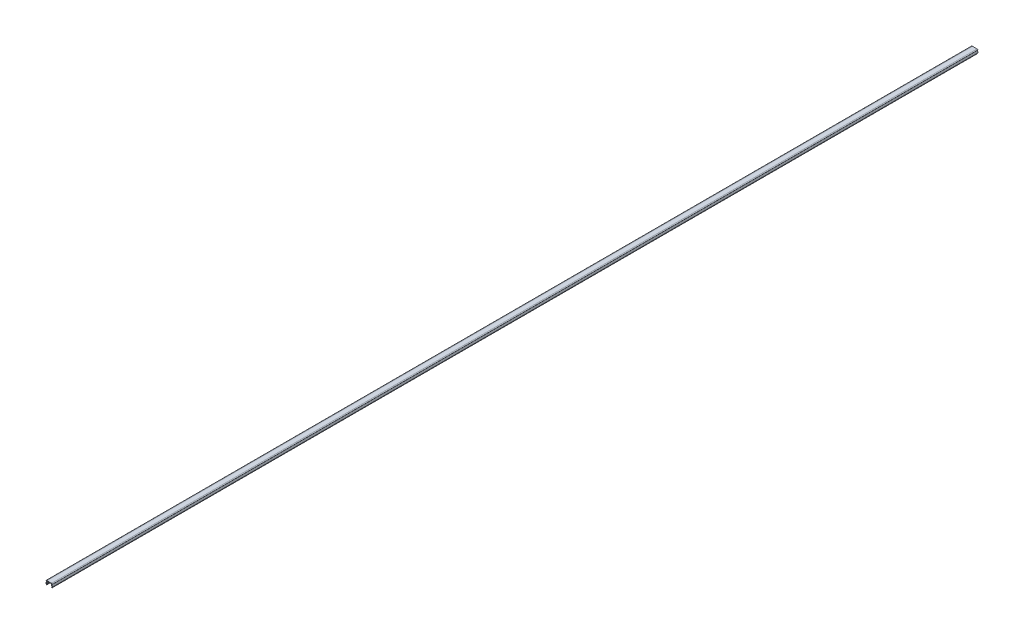
ISO-10303-21;
HEADER;
FILE_DESCRIPTION(('STEP AP214'),'2;1');
FILE_NAME('part.step','',(''),(''),'','','');
FILE_SCHEMA(('AUTOMOTIVE_DESIGN { 1 0 10303 214 1 1 1 1 }'));
ENDSEC;
DATA;
#1=APPLICATION_CONTEXT('core data for automotive mechanical design processes');
#2=APPLICATION_PROTOCOL_DEFINITION('international standard','automotive_design',2000,#1);
#3=PRODUCT_CONTEXT('',#1,'mechanical');
#4=PRODUCT('Part','Part','',(#3));
#5=PRODUCT_RELATED_PRODUCT_CATEGORY('part','',(#4));
#6=PRODUCT_DEFINITION_FORMATION('','',#4);
#7=PRODUCT_DEFINITION_CONTEXT('part definition',#1,'design');
#8=PRODUCT_DEFINITION('design','',#6,#7);
#9=PRODUCT_DEFINITION_SHAPE('','',#8);
#10=(LENGTH_UNIT() NAMED_UNIT(*) SI_UNIT(.MILLI.,.METRE.));
#11=(NAMED_UNIT(*) PLANE_ANGLE_UNIT() SI_UNIT($,.RADIAN.));
#12=(NAMED_UNIT(*) SI_UNIT($,.STERADIAN.) SOLID_ANGLE_UNIT());
#13=UNCERTAINTY_MEASURE_WITH_UNIT(LENGTH_MEASURE(1.E-05),#10,'distance_accuracy_value','');
#14=(GEOMETRIC_REPRESENTATION_CONTEXT(3) GLOBAL_UNCERTAINTY_ASSIGNED_CONTEXT((#13)) GLOBAL_UNIT_ASSIGNED_CONTEXT((#10,
#11,#12)) REPRESENTATION_CONTEXT('',''));
#15=CARTESIAN_POINT('',(0.,0.,0.));
#16=DIRECTION('',(0.,0.,1.));
#17=DIRECTION('',(1.,0.,0.));
#18=AXIS2_PLACEMENT_3D('',#15,#16,#17);
#19=CARTESIAN_POINT('',(0.,4.2,1000.));
#20=DIRECTION('',(0.,-1.,0.));
#21=DIRECTION('',(0.,0.,-1.));
#22=AXIS2_PLACEMENT_3D('',#19,#20,#21);
#23=PLANE('',#22);
#24=DIRECTION('',(-1.,0.,0.));
#25=VECTOR('',#24,1.);
#26=CARTESIAN_POINT('',(0.,4.2,1000.));
#27=LINE('',#26,#25);
#28=CARTESIAN_POINT('',(2.5,4.2,1000.));
#29=VERTEX_POINT('',#28);
#30=CARTESIAN_POINT('',(-2.5,4.2,1000.));
#31=VERTEX_POINT('',#30);
#32=EDGE_CURVE('E242',#29,#31,#27,.T.);
#33=ORIENTED_EDGE('',*,*,#32,.F.);
#34=CARTESIAN_POINT('',(2.5,4.2,-50.));
#35=CARTESIAN_POINT('',(2.5,4.2,316.666666666667));
#36=CARTESIAN_POINT('',(2.5,4.2,683.333333333333));
#37=CARTESIAN_POINT('',(2.5,4.2,1050.));
#38=(BOUNDED_CURVE() B_SPLINE_CURVE(3,(#34,#35,#36,#37),.UNSPECIFIED.,.F.,
.F.) B_SPLINE_CURVE_WITH_KNOTS((4,4),(-1.05,0.05),
.UNSPECIFIED.) CURVE() GEOMETRIC_REPRESENTATION_ITEM() RATIONAL_B_SPLINE_CURVE((1.,1.,1.,1.)) REPRESENTATION_ITEM(''));
#39=CARTESIAN_POINT('',(2.5,4.2,0.));
#40=VERTEX_POINT('',#39);
#41=EDGE_CURVE('E249',#29,#40,#38,.F.);
#42=ORIENTED_EDGE('',*,*,#41,.T.);
#43=DIRECTION('',(-1.,0.,0.));
#44=VECTOR('',#43,1.);
#45=CARTESIAN_POINT('',(0.,4.2,0.));
#46=LINE('',#45,#44);
#47=CARTESIAN_POINT('',(-2.5,4.2,0.));
#48=VERTEX_POINT('',#47);
#49=EDGE_CURVE('E196',#40,#48,#46,.T.);
#50=ORIENTED_EDGE('',*,*,#49,.T.);
#51=CARTESIAN_POINT('',(-2.5,4.2,1050.));
#52=CARTESIAN_POINT('',(-2.5,4.2,683.333333333334));
#53=CARTESIAN_POINT('',(-2.5,4.2,316.666666666666));
#54=CARTESIAN_POINT('',(-2.5,4.2,-49.9999999999998));
#55=(BOUNDED_CURVE() B_SPLINE_CURVE(3,(#51,#52,#53,#54),.UNSPECIFIED.,.F.,
.F.) B_SPLINE_CURVE_WITH_KNOTS((4,4),(-0.05,1.05),
.UNSPECIFIED.) CURVE() GEOMETRIC_REPRESENTATION_ITEM() RATIONAL_B_SPLINE_CURVE((1.,1.,1.,1.)) REPRESENTATION_ITEM(''));
#56=EDGE_CURVE('E368',#48,#31,#55,.F.);
#57=ORIENTED_EDGE('',*,*,#56,.T.);
#58=EDGE_LOOP('',(#33,#42,#50,#57));
#59=FACE_BOUND('',#58,.T.);
#60=ADVANCED_FACE('F20',(#59),#23,.F.);
#61=CARTESIAN_POINT('',(-3.,3.6,1000.));
#62=DIRECTION('',(0.,1.,0.));
#63=DIRECTION('',(-1.,0.,0.));
#64=AXIS2_PLACEMENT_3D('',#61,#62,#63);
#65=PLANE('',#64);
#66=DIRECTION('',(1.,0.,0.));
#67=VECTOR('',#66,1.);
#68=CARTESIAN_POINT('',(-3.,3.6,1000.));
#69=LINE('',#68,#67);
#70=CARTESIAN_POINT('',(-3.3,3.6,1000.));
#71=VERTEX_POINT('',#70);
#72=CARTESIAN_POINT('',(-3.,3.6,1000.));
#73=VERTEX_POINT('',#72);
#74=EDGE_CURVE('E239',#71,#73,#69,.T.);
#75=ORIENTED_EDGE('',*,*,#74,.F.);
#76=DIRECTION('',(0.,0.,-1.));
#77=VECTOR('',#76,1.);
#78=CARTESIAN_POINT('',(-3.3,3.6,1000.));
#79=LINE('',#78,#77);
#80=CARTESIAN_POINT('',(-3.3,3.6,0.));
#81=VERTEX_POINT('',#80);
#82=EDGE_CURVE('E409',#71,#81,#79,.T.);
#83=ORIENTED_EDGE('',*,*,#82,.T.);
#84=DIRECTION('',(1.,0.,0.));
#85=VECTOR('',#84,1.);
#86=CARTESIAN_POINT('',(-3.,3.6,0.));
#87=LINE('',#86,#85);
#88=CARTESIAN_POINT('',(-3.,3.6,0.));
#89=VERTEX_POINT('',#88);
#90=EDGE_CURVE('E462',#81,#89,#87,.T.);
#91=ORIENTED_EDGE('',*,*,#90,.T.);
#92=DIRECTION('',(0.,0.,-1.));
#93=VECTOR('',#92,1.);
#94=CARTESIAN_POINT('',(-3.,3.6,1000.));
#95=LINE('',#94,#93);
#96=EDGE_CURVE('E455',#73,#89,#95,.T.);
#97=ORIENTED_EDGE('',*,*,#96,.F.);
#98=EDGE_LOOP('',(#75,#83,#91,#97));
#99=FACE_BOUND('',#98,.T.);
#100=ADVANCED_FACE('F265',(#99),#65,.F.);
#101=CARTESIAN_POINT('',(-3.,3.6,1000.));
#102=DIRECTION('',(0.982006446980647,-0.188847393650124,0.));
#103=DIRECTION('',(0.188847393650124,0.982006446980647,0.));
#104=AXIS2_PLACEMENT_3D('',#101,#102,#103);
#105=PLANE('',#104);
#106=DIRECTION('',(-0.188847393650124,-0.982006446980647,0.));
#107=VECTOR('',#106,1.);
#108=CARTESIAN_POINT('',(-3.,3.6,0.));
#109=LINE('',#108,#107);
#110=CARTESIAN_POINT('',(-3.48477486743929,1.0791706893157,0.));
#111=VERTEX_POINT('',#110);
#112=EDGE_CURVE('E465',#89,#111,#109,.T.);
#113=ORIENTED_EDGE('',*,*,#112,.T.);
#114=DIRECTION('',(0.,0.,-1.));
#115=VECTOR('',#114,1.);
#116=CARTESIAN_POINT('',(-3.48477486743929,1.0791706893157,1000.));
#117=LINE('',#116,#115);
#118=CARTESIAN_POINT('',(-3.48477486743929,1.0791706893157,1000.));
#119=VERTEX_POINT('',#118);
#120=EDGE_CURVE('E372',#111,#119,#117,.F.);
#121=ORIENTED_EDGE('',*,*,#120,.T.);
#122=DIRECTION('',(-0.188847393650124,-0.982006446980647,0.));
#123=VECTOR('',#122,1.);
#124=CARTESIAN_POINT('',(-3.,3.6,1000.));
#125=LINE('',#124,#123);
#126=EDGE_CURVE('E477',#73,#119,#125,.T.);
#127=ORIENTED_EDGE('',*,*,#126,.F.);
#128=ORIENTED_EDGE('',*,*,#96,.T.);
#129=EDGE_LOOP('',(#113,#121,#127,#128));
#130=FACE_BOUND('',#129,.T.);
#131=ADVANCED_FACE('F474',(#130),#105,.F.);
#132=CARTESIAN_POINT('',(-3.5,1.,1000.));
#133=DIRECTION('',(0.838443616300637,0.544988350595414,0.));
#134=DIRECTION('',(-0.544988350595414,0.838443616300637,0.));
#135=AXIS2_PLACEMENT_3D('',#132,#133,#134);
#136=PLANE('',#135);
#137=DIRECTION('',(0.544988350595414,-0.838443616300637,0.));
#138=VECTOR('',#137,1.);
#139=CARTESIAN_POINT('',(-3.5,1.,1000.));
#140=LINE('',#139,#138);
#141=CARTESIAN_POINT('',(-3.45606230130329,0.932403540466594,1000.));
#142=VERTEX_POINT('',#141);
#143=CARTESIAN_POINT('',(-2.85,0.,1000.));
#144=VERTEX_POINT('',#143);
#145=EDGE_CURVE('E430',#142,#144,#140,.T.);
#146=ORIENTED_EDGE('',*,*,#145,.F.);
#147=DIRECTION('',(0.,0.,-1.));
#148=VECTOR('',#147,1.);
#149=CARTESIAN_POINT('',(-3.45606230130329,0.932403540466594,1000.));
#150=LINE('',#149,#148);
#151=CARTESIAN_POINT('',(-3.45606230130329,0.932403540466594,0.));
#152=VERTEX_POINT('',#151);
#153=EDGE_CURVE('E376',#142,#152,#150,.T.);
#154=ORIENTED_EDGE('',*,*,#153,.T.);
#155=DIRECTION('',(0.544988350595414,-0.838443616300637,0.));
#156=VECTOR('',#155,1.);
#157=CARTESIAN_POINT('',(-3.5,1.,0.));
#158=LINE('',#157,#156);
#159=CARTESIAN_POINT('',(-2.85,0.,0.));
#160=VERTEX_POINT('',#159);
#161=EDGE_CURVE('E445',#152,#160,#158,.T.);
#162=ORIENTED_EDGE('',*,*,#161,.T.);
#163=DIRECTION('',(0.,0.,-1.));
#164=VECTOR('',#163,1.);
#165=CARTESIAN_POINT('',(-2.85,0.,1000.));
#166=LINE('',#165,#164);
#167=EDGE_CURVE('E453',#144,#160,#166,.T.);
#168=ORIENTED_EDGE('',*,*,#167,.F.);
#169=EDGE_LOOP('',(#146,#154,#162,#168));
#170=FACE_BOUND('',#169,.T.);
#171=ADVANCED_FACE('F471',(#170),#136,.F.);
#172=CARTESIAN_POINT('',(-2.55,0.4,1000.));
#173=DIRECTION('',(-0.8,0.6,0.));
#174=DIRECTION('',(-0.6,-0.8,0.));
#175=AXIS2_PLACEMENT_3D('',#172,#173,#174);
#176=PLANE('',#175);
#177=DIRECTION('',(0.6,0.8,0.));
#178=VECTOR('',#177,1.);
#179=CARTESIAN_POINT('',(-2.55,0.4,0.));
#180=LINE('',#179,#178);
#181=CARTESIAN_POINT('',(-2.61982073629337,0.306905684942176,0.));
#182=VERTEX_POINT('',#181);
#183=EDGE_CURVE('E425',#160,#182,#180,.T.);
#184=ORIENTED_EDGE('',*,*,#183,.T.);
#185=DIRECTION('',(0.,0.,-1.));
#186=VECTOR('',#185,1.);
#187=CARTESIAN_POINT('',(-2.61982073629337,0.306905684942176,1000.));
#188=LINE('',#187,#186);
#189=CARTESIAN_POINT('',(-2.61982073629337,0.306905684942176,1000.));
#190=VERTEX_POINT('',#189);
#191=EDGE_CURVE('E384',#182,#190,#188,.F.);
#192=ORIENTED_EDGE('',*,*,#191,.T.);
#193=DIRECTION('',(0.6,0.8,0.));
#194=VECTOR('',#193,1.);
#195=CARTESIAN_POINT('',(-2.55,0.4,1000.));
#196=LINE('',#195,#194);
#197=EDGE_CURVE('E424',#144,#190,#196,.T.);
#198=ORIENTED_EDGE('',*,*,#197,.F.);
#199=ORIENTED_EDGE('',*,*,#167,.T.);
#200=EDGE_LOOP('',(#184,#192,#198,#199));
#201=FACE_BOUND('',#200,.T.);
#202=ADVANCED_FACE('F422',(#201),#176,.F.);
#203=CARTESIAN_POINT('',(-2.86512073412948,1.12420363175703,1000.));
#204=DIRECTION('',(-0.916954462074289,-0.398991872701753,0.));
#205=DIRECTION('',(0.398991872701753,-0.916954462074289,0.));
#206=AXIS2_PLACEMENT_3D('',#203,#204,#205);
#207=PLANE('',#206);
#208=DIRECTION('',(-0.398991872701753,0.916954462074289,0.));
#209=VECTOR('',#208,1.);
#210=CARTESIAN_POINT('',(-2.86512073412948,1.12420363175703,1000.));
#211=LINE('',#210,#209);
#212=CARTESIAN_POINT('',(-2.59642984387851,0.506704059482526,1000.));
#213=VERTEX_POINT('',#212);
#214=CARTESIAN_POINT('',(-2.86512073412948,1.12420363175703,1000.));
#215=VERTEX_POINT('',#214);
#216=EDGE_CURVE('E432',#213,#215,#211,.T.);
#217=ORIENTED_EDGE('',*,*,#216,.F.);
#218=DIRECTION('',(0.,0.,-1.));
#219=VECTOR('',#218,1.);
#220=CARTESIAN_POINT('',(-2.59642984387851,0.506704059482526,1000.));
#221=LINE('',#220,#219);
#222=CARTESIAN_POINT('',(-2.59642984387851,0.506704059482526,0.));
#223=VERTEX_POINT('',#222);
#224=EDGE_CURVE('E416',#213,#223,#221,.T.);
#225=ORIENTED_EDGE('',*,*,#224,.T.);
#226=DIRECTION('',(-0.398991872701753,0.916954462074289,0.));
#227=VECTOR('',#226,1.);
#228=CARTESIAN_POINT('',(-2.86512073412948,1.12420363175703,0.));
#229=LINE('',#228,#227);
#230=CARTESIAN_POINT('',(-2.86512073412948,1.12420363175703,0.));
#231=VERTEX_POINT('',#230);
#232=EDGE_CURVE('E439',#223,#231,#229,.T.);
#233=ORIENTED_EDGE('',*,*,#232,.T.);
#234=DIRECTION('',(0.,0.,-1.));
#235=VECTOR('',#234,1.);
#236=CARTESIAN_POINT('',(-2.86512073412948,1.12420363175703,1000.));
#237=LINE('',#236,#235);
#238=EDGE_CURVE('E451',#215,#231,#237,.T.);
#239=ORIENTED_EDGE('',*,*,#238,.F.);
#240=EDGE_LOOP('',(#217,#225,#233,#239));
#241=FACE_BOUND('',#240,.T.);
#242=ADVANCED_FACE('F437',(#241),#207,.F.);
#243=CARTESIAN_POINT('',(-2.3890060479289,3.6,1000.));
#244=DIRECTION('',(-0.982006446980647,0.188847393650125,0.));
#245=DIRECTION('',(-0.188847393650125,-0.982006446980647,0.));
#246=AXIS2_PLACEMENT_3D('',#243,#244,#245);
#247=PLANE('',#246);
#248=DIRECTION('',(0.188847393650125,0.982006446980647,0.));
#249=VECTOR('',#248,1.);
#250=CARTESIAN_POINT('',(-2.3890060479289,3.6,0.));
#251=LINE('',#250,#249);
#252=CARTESIAN_POINT('',(-2.3890060479289,3.6,0.));
#253=VERTEX_POINT('',#252);
#254=EDGE_CURVE('E442',#231,#253,#251,.T.);
#255=ORIENTED_EDGE('',*,*,#254,.T.);
#256=DIRECTION('',(0.,0.,-1.));
#257=VECTOR('',#256,1.);
#258=CARTESIAN_POINT('',(-2.3890060479289,3.6,1000.));
#259=LINE('',#258,#257);
#260=CARTESIAN_POINT('',(-2.3890060479289,3.6,1000.));
#261=VERTEX_POINT('',#260);
#262=EDGE_CURVE('E186',#261,#253,#259,.T.);
#263=ORIENTED_EDGE('',*,*,#262,.F.);
#264=DIRECTION('',(0.188847393650125,0.982006446980647,0.));
#265=VECTOR('',#264,1.);
#266=CARTESIAN_POINT('',(-2.3890060479289,3.6,1000.));
#267=LINE('',#266,#265);
#268=EDGE_CURVE('E182',#215,#261,#267,.T.);
#269=ORIENTED_EDGE('',*,*,#268,.F.);
#270=ORIENTED_EDGE('',*,*,#238,.T.);
#271=EDGE_LOOP('',(#255,#263,#269,#270));
#272=FACE_BOUND('',#271,.T.);
#273=ADVANCED_FACE('F482',(#272),#247,.F.);
#274=CARTESIAN_POINT('',(0.,3.6,1000.));
#275=DIRECTION('',(0.,1.,0.));
#276=DIRECTION('',(-1.,0.,0.));
#277=AXIS2_PLACEMENT_3D('',#274,#275,#276);
#278=PLANE('',#277);
#279=DIRECTION('',(1.,0.,0.));
#280=VECTOR('',#279,1.);
#281=CARTESIAN_POINT('',(0.,3.6,0.));
#282=LINE('',#281,#280);
#283=CARTESIAN_POINT('',(2.3890060479289,3.6,0.));
#284=VERTEX_POINT('',#283);
#285=EDGE_CURVE('E192',#253,#284,#282,.T.);
#286=ORIENTED_EDGE('',*,*,#285,.T.);
#287=DIRECTION('',(0.,0.,-1.));
#288=VECTOR('',#287,1.);
#289=CARTESIAN_POINT('',(2.3890060479289,3.6,1000.));
#290=LINE('',#289,#288);
#291=CARTESIAN_POINT('',(2.3890060479289,3.6,1000.));
#292=VERTEX_POINT('',#291);
#293=EDGE_CURVE('E189',#292,#284,#290,.T.);
#294=ORIENTED_EDGE('',*,*,#293,.F.);
#295=DIRECTION('',(1.,0.,0.));
#296=VECTOR('',#295,1.);
#297=CARTESIAN_POINT('',(0.,3.6,1000.));
#298=LINE('',#297,#296);
#299=EDGE_CURVE('E175',#261,#292,#298,.T.);
#300=ORIENTED_EDGE('',*,*,#299,.F.);
#301=ORIENTED_EDGE('',*,*,#262,.T.);
#302=EDGE_LOOP('',(#286,#294,#300,#301));
#303=FACE_BOUND('',#302,.T.);
#304=ADVANCED_FACE('F190',(#303),#278,.F.);
#305=CARTESIAN_POINT('',(0.,0.,1000.));
#306=DIRECTION('',(0.,0.,1.));
#307=DIRECTION('',(1.,0.,0.));
#308=AXIS2_PLACEMENT_3D('',#305,#306,#307);
#309=PLANE('',#308);
#310=CARTESIAN_POINT('',(3.3,3.8,1000.));
#311=DIRECTION('',(0.,0.,1.));
#312=DIRECTION('',(1.,0.,0.));
#313=AXIS2_PLACEMENT_3D('',#310,#311,#312);
#314=CIRCLE('',#313,0.2);
#315=CARTESIAN_POINT('',(3.3,3.6,1000.));
#316=VERTEX_POINT('',#315);
#317=CARTESIAN_POINT('',(3.5,3.8,1000.));
#318=VERTEX_POINT('',#317);
#319=EDGE_CURVE('E312',#316,#318,#314,.T.);
#320=ORIENTED_EDGE('',*,*,#319,.T.);
#321=CARTESIAN_POINT('',(2.5,4.2,1000.));
#322=CARTESIAN_POINT('',(3.5,4.2,1000.));
#323=CARTESIAN_POINT('',(3.5,3.8,1000.));
#324=(BOUNDED_CURVE() B_SPLINE_CURVE(2,(#321,#322,#323),.UNSPECIFIED.,.F.,
.F.) B_SPLINE_CURVE_WITH_KNOTS((3,3),(0.,1.),
.UNSPECIFIED.) CURVE() GEOMETRIC_REPRESENTATION_ITEM() RATIONAL_B_SPLINE_CURVE((1.,
0.707106781186548,1.)) REPRESENTATION_ITEM(''));
#325=EDGE_CURVE('E11',#318,#29,#324,.F.);
#326=ORIENTED_EDGE('',*,*,#325,.T.);
#327=ORIENTED_EDGE('',*,*,#32,.T.);
#328=CARTESIAN_POINT('',(-3.5,3.8,1000.));
#329=CARTESIAN_POINT('',(-3.5,4.2,1000.));
#330=CARTESIAN_POINT('',(-2.5,4.2,1000.));
#331=(BOUNDED_CURVE() B_SPLINE_CURVE(2,(#328,#329,#330),.UNSPECIFIED.,.F.,
.F.) B_SPLINE_CURVE_WITH_KNOTS((3,3),(0.,1.),
.UNSPECIFIED.) CURVE() GEOMETRIC_REPRESENTATION_ITEM() RATIONAL_B_SPLINE_CURVE((1.,
0.707106781186548,1.)) REPRESENTATION_ITEM(''));
#332=CARTESIAN_POINT('',(-3.5,3.8,1000.));
#333=VERTEX_POINT('',#332);
#334=EDGE_CURVE('E285',#31,#333,#331,.F.);
#335=ORIENTED_EDGE('',*,*,#334,.T.);
#336=CARTESIAN_POINT('',(-3.3,3.8,1000.));
#337=DIRECTION('',(0.,0.,1.));
#338=DIRECTION('',(1.,0.,0.));
#339=AXIS2_PLACEMENT_3D('',#336,#337,#338);
#340=CIRCLE('',#339,0.2);
#341=EDGE_CURVE('E291',#333,#71,#340,.T.);
#342=ORIENTED_EDGE('',*,*,#341,.T.);
#343=ORIENTED_EDGE('',*,*,#74,.T.);
#344=ORIENTED_EDGE('',*,*,#126,.T.);
#345=CARTESIAN_POINT('',(-3.28837357804316,1.04140121058568,1000.));
#346=DIRECTION('',(0.,0.,1.));
#347=DIRECTION('',(1.,0.,0.));
#348=AXIS2_PLACEMENT_3D('',#345,#346,#347);
#349=CIRCLE('',#348,0.2);
#350=EDGE_CURVE('E403',#119,#142,#349,.T.);
#351=ORIENTED_EDGE('',*,*,#350,.T.);
#352=ORIENTED_EDGE('',*,*,#145,.T.);
#353=ORIENTED_EDGE('',*,*,#197,.T.);
#354=CARTESIAN_POINT('',(-2.77982073629337,0.426905684942176,1000.));
#355=DIRECTION('',(0.,0.,1.));
#356=DIRECTION('',(1.,0.,0.));
#357=AXIS2_PLACEMENT_3D('',#354,#355,#356);
#358=CIRCLE('',#357,0.2);
#359=EDGE_CURVE('E414',#190,#213,#358,.T.);
#360=ORIENTED_EDGE('',*,*,#359,.T.);
#361=ORIENTED_EDGE('',*,*,#216,.T.);
#362=ORIENTED_EDGE('',*,*,#268,.T.);
#363=ORIENTED_EDGE('',*,*,#299,.T.);
#364=DIRECTION('',(-0.188847393650125,0.982006446980647,0.));
#365=VECTOR('',#364,1.);
#366=CARTESIAN_POINT('',(2.3890060479289,3.6,1000.));
#367=LINE('',#366,#365);
#368=CARTESIAN_POINT('',(2.86512073412948,1.12420363175703,1000.));
#369=VERTEX_POINT('',#368);
#370=EDGE_CURVE('E180',#369,#292,#367,.T.);
#371=ORIENTED_EDGE('',*,*,#370,.F.);
#372=DIRECTION('',(0.398991872701753,0.916954462074289,0.));
#373=VECTOR('',#372,1.);
#374=CARTESIAN_POINT('',(2.86512073412948,1.12420363175703,1000.));
#375=LINE('',#374,#373);
#376=CARTESIAN_POINT('',(2.59642984387851,0.506704059482527,1000.));
#377=VERTEX_POINT('',#376);
#378=EDGE_CURVE('E202',#377,#369,#375,.T.);
#379=ORIENTED_EDGE('',*,*,#378,.F.);
#380=CARTESIAN_POINT('',(2.77982073629337,0.426905684942177,1000.));
#381=DIRECTION('',(0.,0.,1.));
#382=DIRECTION('',(1.,0.,0.));
#383=AXIS2_PLACEMENT_3D('',#380,#381,#382);
#384=CIRCLE('',#383,0.2);
#385=CARTESIAN_POINT('',(2.61982073629337,0.306905684942177,1000.));
#386=VERTEX_POINT('',#385);
#387=EDGE_CURVE('E320',#377,#386,#384,.T.);
#388=ORIENTED_EDGE('',*,*,#387,.T.);
#389=DIRECTION('',(-0.6,0.8,0.));
#390=VECTOR('',#389,1.);
#391=CARTESIAN_POINT('',(2.55,0.400000000000001,1000.));
#392=LINE('',#391,#390);
#393=CARTESIAN_POINT('',(2.85,0.,1000.));
#394=VERTEX_POINT('',#393);
#395=EDGE_CURVE('E205',#394,#386,#392,.T.);
#396=ORIENTED_EDGE('',*,*,#395,.F.);
#397=DIRECTION('',(-0.544988350595414,-0.838443616300637,0.));
#398=VECTOR('',#397,1.);
#399=CARTESIAN_POINT('',(3.5,1.,1000.));
#400=LINE('',#399,#398);
#401=CARTESIAN_POINT('',(3.45606230130329,0.932403540466595,1000.));
#402=VERTEX_POINT('',#401);
#403=EDGE_CURVE('E212',#402,#394,#400,.T.);
#404=ORIENTED_EDGE('',*,*,#403,.F.);
#405=CARTESIAN_POINT('',(3.28837357804316,1.04140121058568,1000.));
#406=DIRECTION('',(0.,0.,1.));
#407=DIRECTION('',(1.,0.,0.));
#408=AXIS2_PLACEMENT_3D('',#405,#406,#407);
#409=CIRCLE('',#408,0.2);
#410=CARTESIAN_POINT('',(3.48477486743929,1.0791706893157,1000.));
#411=VERTEX_POINT('',#410);
#412=EDGE_CURVE('E494',#402,#411,#409,.T.);
#413=ORIENTED_EDGE('',*,*,#412,.T.);
#414=DIRECTION('',(0.188847393650125,-0.982006446980647,0.));
#415=VECTOR('',#414,1.);
#416=CARTESIAN_POINT('',(3.,3.6,1000.));
#417=LINE('',#416,#415);
#418=CARTESIAN_POINT('',(3.,3.6,1000.));
#419=VERTEX_POINT('',#418);
#420=EDGE_CURVE('E214',#419,#411,#417,.T.);
#421=ORIENTED_EDGE('',*,*,#420,.F.);
#422=DIRECTION('',(-1.,0.,0.));
#423=VECTOR('',#422,1.);
#424=CARTESIAN_POINT('',(3.,3.6,1000.));
#425=LINE('',#424,#423);
#426=EDGE_CURVE('E217',#316,#419,#425,.T.);
#427=ORIENTED_EDGE('',*,*,#426,.F.);
#428=EDGE_LOOP('',(#320,#326,#327,#335,#342,#343,#344,#351,#352,#353,#360,#361,#362,#363,#371,
#379,#388,#396,#404,#413,#421,#427));
#429=FACE_BOUND('',#428,.T.);
#430=ADVANCED_FACE('F177',(#429),#309,.T.);
#431=CARTESIAN_POINT('',(0.,0.,0.));
#432=DIRECTION('',(0.,0.,1.));
#433=DIRECTION('',(1.,0.,0.));
#434=AXIS2_PLACEMENT_3D('',#431,#432,#433);
#435=PLANE('',#434);
#436=ORIENTED_EDGE('',*,*,#49,.F.);
#437=CARTESIAN_POINT('',(3.5,3.8,0.));
#438=CARTESIAN_POINT('',(3.5,4.2,0.));
#439=CARTESIAN_POINT('',(2.5,4.2,0.));
#440=(BOUNDED_CURVE() B_SPLINE_CURVE(2,(#437,#438,#439),.UNSPECIFIED.,.F.,
.F.) B_SPLINE_CURVE_WITH_KNOTS((3,3),(0.,1.),
.UNSPECIFIED.) CURVE() GEOMETRIC_REPRESENTATION_ITEM() RATIONAL_B_SPLINE_CURVE((1.,
0.707106781186548,1.)) REPRESENTATION_ITEM(''));
#441=CARTESIAN_POINT('',(3.5,3.8,0.));
#442=VERTEX_POINT('',#441);
#443=EDGE_CURVE('E35',#40,#442,#440,.F.);
#444=ORIENTED_EDGE('',*,*,#443,.T.);
#445=CARTESIAN_POINT('',(3.3,3.8,0.));
#446=DIRECTION('',(0.,0.,1.));
#447=DIRECTION('',(1.,0.,0.));
#448=AXIS2_PLACEMENT_3D('',#445,#446,#447);
#449=CIRCLE('',#448,0.2);
#450=CARTESIAN_POINT('',(3.3,3.6,0.));
#451=VERTEX_POINT('',#450);
#452=EDGE_CURVE('E364',#442,#451,#449,.F.);
#453=ORIENTED_EDGE('',*,*,#452,.T.);
#454=DIRECTION('',(-1.,0.,0.));
#455=VECTOR('',#454,1.);
#456=CARTESIAN_POINT('',(3.,3.6,0.));
#457=LINE('',#456,#455);
#458=CARTESIAN_POINT('',(3.,3.6,0.));
#459=VERTEX_POINT('',#458);
#460=EDGE_CURVE('E203',#451,#459,#457,.T.);
#461=ORIENTED_EDGE('',*,*,#460,.T.);
#462=DIRECTION('',(0.188847393650125,-0.982006446980647,0.));
#463=VECTOR('',#462,1.);
#464=CARTESIAN_POINT('',(3.,3.6,0.));
#465=LINE('',#464,#463);
#466=CARTESIAN_POINT('',(3.48477486743929,1.0791706893157,0.));
#467=VERTEX_POINT('',#466);
#468=EDGE_CURVE('E207',#459,#467,#465,.T.);
#469=ORIENTED_EDGE('',*,*,#468,.T.);
#470=CARTESIAN_POINT('',(3.28837357804316,1.04140121058568,0.));
#471=DIRECTION('',(0.,0.,1.));
#472=DIRECTION('',(1.,0.,0.));
#473=AXIS2_PLACEMENT_3D('',#470,#471,#472);
#474=CIRCLE('',#473,0.2);
#475=CARTESIAN_POINT('',(3.45606230130329,0.932403540466595,0.));
#476=VERTEX_POINT('',#475);
#477=EDGE_CURVE('E365',#467,#476,#474,.F.);
#478=ORIENTED_EDGE('',*,*,#477,.T.);
#479=DIRECTION('',(-0.544988350595414,-0.838443616300637,0.));
#480=VECTOR('',#479,1.);
#481=CARTESIAN_POINT('',(3.5,1.,0.));
#482=LINE('',#481,#480);
#483=CARTESIAN_POINT('',(2.85,0.,0.));
#484=VERTEX_POINT('',#483);
#485=EDGE_CURVE('E227',#476,#484,#482,.T.);
#486=ORIENTED_EDGE('',*,*,#485,.T.);
#487=DIRECTION('',(-0.6,0.8,0.));
#488=VECTOR('',#487,1.);
#489=CARTESIAN_POINT('',(2.55,0.400000000000001,0.));
#490=LINE('',#489,#488);
#491=CARTESIAN_POINT('',(2.61982073629337,0.306905684942177,0.));
#492=VERTEX_POINT('',#491);
#493=EDGE_CURVE('E224',#484,#492,#490,.T.);
#494=ORIENTED_EDGE('',*,*,#493,.T.);
#495=CARTESIAN_POINT('',(2.77982073629337,0.426905684942177,0.));
#496=DIRECTION('',(0.,0.,1.));
#497=DIRECTION('',(1.,0.,0.));
#498=AXIS2_PLACEMENT_3D('',#495,#496,#497);
#499=CIRCLE('',#498,0.2);
#500=CARTESIAN_POINT('',(2.59642984387851,0.506704059482527,0.));
#501=VERTEX_POINT('',#500);
#502=EDGE_CURVE('E366',#492,#501,#499,.F.);
#503=ORIENTED_EDGE('',*,*,#502,.T.);
#504=DIRECTION('',(0.398991872701753,0.916954462074289,0.));
#505=VECTOR('',#504,1.);
#506=CARTESIAN_POINT('',(2.86512073412948,1.12420363175703,0.));
#507=LINE('',#506,#505);
#508=CARTESIAN_POINT('',(2.86512073412948,1.12420363175703,0.));
#509=VERTEX_POINT('',#508);
#510=EDGE_CURVE('E222',#501,#509,#507,.T.);
#511=ORIENTED_EDGE('',*,*,#510,.T.);
#512=DIRECTION('',(-0.188847393650125,0.982006446980647,0.));
#513=VECTOR('',#512,1.);
#514=CARTESIAN_POINT('',(2.3890060479289,3.6,0.));
#515=LINE('',#514,#513);
#516=EDGE_CURVE('E220',#509,#284,#515,.T.);
#517=ORIENTED_EDGE('',*,*,#516,.T.);
#518=ORIENTED_EDGE('',*,*,#285,.F.);
#519=ORIENTED_EDGE('',*,*,#254,.F.);
#520=ORIENTED_EDGE('',*,*,#232,.F.);
#521=CARTESIAN_POINT('',(-2.77982073629337,0.426905684942176,0.));
#522=DIRECTION('',(0.,0.,1.));
#523=DIRECTION('',(1.,0.,0.));
#524=AXIS2_PLACEMENT_3D('',#521,#522,#523);
#525=CIRCLE('',#524,0.2);
#526=EDGE_CURVE('E398',#223,#182,#525,.F.);
#527=ORIENTED_EDGE('',*,*,#526,.T.);
#528=ORIENTED_EDGE('',*,*,#183,.F.);
#529=ORIENTED_EDGE('',*,*,#161,.F.);
#530=CARTESIAN_POINT('',(-3.28837357804316,1.04140121058568,0.));
#531=DIRECTION('',(0.,0.,1.));
#532=DIRECTION('',(1.,0.,0.));
#533=AXIS2_PLACEMENT_3D('',#530,#531,#532);
#534=CIRCLE('',#533,0.2);
#535=EDGE_CURVE('E404',#152,#111,#534,.F.);
#536=ORIENTED_EDGE('',*,*,#535,.T.);
#537=ORIENTED_EDGE('',*,*,#112,.F.);
#538=ORIENTED_EDGE('',*,*,#90,.F.);
#539=CARTESIAN_POINT('',(-3.3,3.8,0.));
#540=DIRECTION('',(0.,0.,1.));
#541=DIRECTION('',(1.,0.,0.));
#542=AXIS2_PLACEMENT_3D('',#539,#540,#541);
#543=CIRCLE('',#542,0.2);
#544=CARTESIAN_POINT('',(-3.5,3.8,0.));
#545=VERTEX_POINT('',#544);
#546=EDGE_CURVE('E391',#81,#545,#543,.F.);
#547=ORIENTED_EDGE('',*,*,#546,.T.);
#548=CARTESIAN_POINT('',(-2.5,4.2,1.97758476261356E-13));
#549=CARTESIAN_POINT('',(-3.5,4.2,1.98714826802165E-13));
#550=CARTESIAN_POINT('',(-3.5,3.8,1.97758476261356E-13));
#551=(BOUNDED_CURVE() B_SPLINE_CURVE(2,(#548,#549,#550),.UNSPECIFIED.,.F.,
.F.) B_SPLINE_CURVE_WITH_KNOTS((3,3),(0.,1.),
.UNSPECIFIED.) CURVE() GEOMETRIC_REPRESENTATION_ITEM() RATIONAL_B_SPLINE_CURVE((1.,
0.707106781186548,1.)) REPRESENTATION_ITEM(''));
#552=EDGE_CURVE('E369',#545,#48,#551,.F.);
#553=ORIENTED_EDGE('',*,*,#552,.T.);
#554=EDGE_LOOP('',(#436,#444,#453,#461,#469,#478,#486,#494,#503,#511,#517,#518,#519,#520,#527,
#528,#529,#536,#537,#538,#547,#553));
#555=FACE_BOUND('',#554,.T.);
#556=ADVANCED_FACE('F302',(#555),#435,.F.);
#557=CARTESIAN_POINT('',(-3.3,3.8,1000.));
#558=DIRECTION('',(0.,0.,-1.));
#559=DIRECTION('',(-1.,0.,0.));
#560=AXIS2_PLACEMENT_3D('',#557,#558,#559);
#561=CYLINDRICAL_SURFACE('',#560,0.2);
#562=ORIENTED_EDGE('',*,*,#341,.F.);
#563=CARTESIAN_POINT('',(-3.5,3.8,-49.9999999999998));
#564=CARTESIAN_POINT('',(-3.5,3.8,316.666666666666));
#565=CARTESIAN_POINT('',(-3.5,3.8,683.333333333334));
#566=CARTESIAN_POINT('',(-3.5,3.8,1050.));
#567=(BOUNDED_CURVE() B_SPLINE_CURVE(3,(#563,#564,#565,#566),.UNSPECIFIED.,.F.,
.F.) B_SPLINE_CURVE_WITH_KNOTS((4,4),(-0.05,1.05),
.UNSPECIFIED.) CURVE() GEOMETRIC_REPRESENTATION_ITEM() RATIONAL_B_SPLINE_CURVE((1.,1.,1.,1.)) REPRESENTATION_ITEM(''));
#568=EDGE_CURVE('E397',#545,#333,#567,.T.);
#569=ORIENTED_EDGE('',*,*,#568,.F.);
#570=ORIENTED_EDGE('',*,*,#546,.F.);
#571=ORIENTED_EDGE('',*,*,#82,.F.);
#572=EDGE_LOOP('',(#562,#569,#570,#571));
#573=FACE_BOUND('',#572,.T.);
#574=ADVANCED_FACE('F267',(#573),#561,.T.);
#575=CARTESIAN_POINT('',(-2.77982073629337,0.426905684942176,1000.));
#576=DIRECTION('',(0.,0.,-1.));
#577=DIRECTION('',(-1.,0.,0.));
#578=AXIS2_PLACEMENT_3D('',#575,#576,#577);
#579=CYLINDRICAL_SURFACE('',#578,0.2);
#580=ORIENTED_EDGE('',*,*,#359,.F.);
#581=ORIENTED_EDGE('',*,*,#191,.F.);
#582=ORIENTED_EDGE('',*,*,#526,.F.);
#583=ORIENTED_EDGE('',*,*,#224,.F.);
#584=EDGE_LOOP('',(#580,#581,#582,#583));
#585=FACE_BOUND('',#584,.T.);
#586=ADVANCED_FACE('F435',(#585),#579,.T.);
#587=CARTESIAN_POINT('',(-3.28837357804316,1.04140121058568,1000.));
#588=DIRECTION('',(0.,0.,-1.));
#589=DIRECTION('',(-1.,0.,0.));
#590=AXIS2_PLACEMENT_3D('',#587,#588,#589);
#591=CYLINDRICAL_SURFACE('',#590,0.2);
#592=ORIENTED_EDGE('',*,*,#350,.F.);
#593=ORIENTED_EDGE('',*,*,#120,.F.);
#594=ORIENTED_EDGE('',*,*,#535,.F.);
#595=ORIENTED_EDGE('',*,*,#153,.F.);
#596=EDGE_LOOP('',(#592,#593,#594,#595));
#597=FACE_BOUND('',#596,.T.);
#598=ADVANCED_FACE('F476',(#597),#591,.T.);
#599=CARTESIAN_POINT('',(-3.5,3.8,1050.));
#600=CARTESIAN_POINT('',(-3.5,3.8,683.333333333334));
#601=CARTESIAN_POINT('',(-3.5,3.8,316.666666666666));
#602=CARTESIAN_POINT('',(-3.5,3.8,-49.9999999999998));
#603=CARTESIAN_POINT('',(-3.5,4.2,1050.));
#604=CARTESIAN_POINT('',(-3.5,4.2,683.333333333334));
#605=CARTESIAN_POINT('',(-3.5,4.2,316.666666666666));
#606=CARTESIAN_POINT('',(-3.5,4.2,-49.9999999999998));
#607=CARTESIAN_POINT('',(-2.5,4.2,1050.));
#608=CARTESIAN_POINT('',(-2.5,4.2,683.333333333334));
#609=CARTESIAN_POINT('',(-2.5,4.2,316.666666666666));
#610=CARTESIAN_POINT('',(-2.5,4.2,-49.9999999999998));
#611=(BOUNDED_SURFACE() B_SPLINE_SURFACE(2,3,((#599,#600,#601,#602),(#603,#604,#605,#606),(#607,
#608,#609,#610)),.UNSPECIFIED.,.F.,.F.,.F.) B_SPLINE_SURFACE_WITH_KNOTS((3,3),(4,4),(0.,1.),
(-0.05,1.05),.UNSPECIFIED.) GEOMETRIC_REPRESENTATION_ITEM() RATIONAL_B_SPLINE_SURFACE(((1.,1.,
1.,1.),(0.707106781186548,0.707106781186548,0.707106781186548,0.707106781186548),(1.,1.,1.,1.))) REPRESENTATION_ITEM('') SURFACE());
#612=ORIENTED_EDGE('',*,*,#334,.F.);
#613=ORIENTED_EDGE('',*,*,#56,.F.);
#614=ORIENTED_EDGE('',*,*,#552,.F.);
#615=ORIENTED_EDGE('',*,*,#568,.T.);
#616=EDGE_LOOP('',(#612,#613,#614,#615));
#617=FACE_BOUND('',#616,.T.);
#618=ADVANCED_FACE('F532',(#617),#611,.T.);
#619=CARTESIAN_POINT('',(2.3890060479289,3.6,1000.));
#620=DIRECTION('',(-0.982006446980647,-0.188847393650125,0.));
#621=DIRECTION('',(0.188847393650125,-0.982006446980647,0.));
#622=AXIS2_PLACEMENT_3D('',#619,#620,#621);
#623=PLANE('',#622);
#624=ORIENTED_EDGE('',*,*,#516,.F.);
#625=DIRECTION('',(0.,0.,-1.));
#626=VECTOR('',#625,1.);
#627=CARTESIAN_POINT('',(2.86512073412948,1.12420363175703,1000.));
#628=LINE('',#627,#626);
#629=EDGE_CURVE('E197',#369,#509,#628,.T.);
#630=ORIENTED_EDGE('',*,*,#629,.F.);
#631=ORIENTED_EDGE('',*,*,#370,.T.);
#632=ORIENTED_EDGE('',*,*,#293,.T.);
#633=EDGE_LOOP('',(#624,#630,#631,#632));
#634=FACE_BOUND('',#633,.T.);
#635=ADVANCED_FACE('F200',(#634),#623,.T.);
#636=CARTESIAN_POINT('',(2.86512073412948,1.12420363175703,1000.));
#637=DIRECTION('',(-0.916954462074289,0.398991872701753,0.));
#638=DIRECTION('',(-0.398991872701753,-0.916954462074289,0.));
#639=AXIS2_PLACEMENT_3D('',#636,#637,#638);
#640=PLANE('',#639);
#641=ORIENTED_EDGE('',*,*,#510,.F.);
#642=DIRECTION('',(0.,0.,-1.));
#643=VECTOR('',#642,1.);
#644=CARTESIAN_POINT('',(2.59642984387851,0.506704059482528,1000.));
#645=LINE('',#644,#643);
#646=EDGE_CURVE('E487',#501,#377,#645,.F.);
#647=ORIENTED_EDGE('',*,*,#646,.T.);
#648=ORIENTED_EDGE('',*,*,#378,.T.);
#649=ORIENTED_EDGE('',*,*,#629,.T.);
#650=EDGE_LOOP('',(#641,#647,#648,#649));
#651=FACE_BOUND('',#650,.T.);
#652=ADVANCED_FACE('F486',(#651),#640,.T.);
#653=CARTESIAN_POINT('',(2.55,0.400000000000001,1000.));
#654=DIRECTION('',(-0.8,-0.6,0.));
#655=DIRECTION('',(0.6,-0.8,0.));
#656=AXIS2_PLACEMENT_3D('',#653,#654,#655);
#657=PLANE('',#656);
#658=ORIENTED_EDGE('',*,*,#395,.T.);
#659=DIRECTION('',(0.,0.,-1.));
#660=VECTOR('',#659,1.);
#661=CARTESIAN_POINT('',(2.61982073629337,0.306905684942177,1000.));
#662=LINE('',#661,#660);
#663=EDGE_CURVE('E319',#386,#492,#662,.T.);
#664=ORIENTED_EDGE('',*,*,#663,.T.);
#665=ORIENTED_EDGE('',*,*,#493,.F.);
#666=DIRECTION('',(0.,0.,-1.));
#667=VECTOR('',#666,1.);
#668=CARTESIAN_POINT('',(2.85,0.,1000.));
#669=LINE('',#668,#667);
#670=EDGE_CURVE('E233',#394,#484,#669,.T.);
#671=ORIENTED_EDGE('',*,*,#670,.F.);
#672=EDGE_LOOP('',(#658,#664,#665,#671));
#673=FACE_BOUND('',#672,.T.);
#674=ADVANCED_FACE('F618',(#673),#657,.T.);
#675=CARTESIAN_POINT('',(3.5,1.,1000.));
#676=DIRECTION('',(0.838443616300637,-0.544988350595414,0.));
#677=DIRECTION('',(0.544988350595414,0.838443616300637,0.));
#678=AXIS2_PLACEMENT_3D('',#675,#676,#677);
#679=PLANE('',#678);
#680=ORIENTED_EDGE('',*,*,#485,.F.);
#681=DIRECTION('',(0.,0.,-1.));
#682=VECTOR('',#681,1.);
#683=CARTESIAN_POINT('',(3.45606230130329,0.932403540466595,1000.));
#684=LINE('',#683,#682);
#685=EDGE_CURVE('E504',#476,#402,#684,.F.);
#686=ORIENTED_EDGE('',*,*,#685,.T.);
#687=ORIENTED_EDGE('',*,*,#403,.T.);
#688=ORIENTED_EDGE('',*,*,#670,.T.);
#689=EDGE_LOOP('',(#680,#686,#687,#688));
#690=FACE_BOUND('',#689,.T.);
#691=ADVANCED_FACE('F614',(#690),#679,.T.);
#692=CARTESIAN_POINT('',(3.,3.6,1000.));
#693=DIRECTION('',(0.982006446980647,0.188847393650125,0.));
#694=DIRECTION('',(-0.188847393650125,0.982006446980647,0.));
#695=AXIS2_PLACEMENT_3D('',#692,#693,#694);
#696=PLANE('',#695);
#697=ORIENTED_EDGE('',*,*,#420,.T.);
#698=DIRECTION('',(0.,0.,-1.));
#699=VECTOR('',#698,1.);
#700=CARTESIAN_POINT('',(3.48477486743929,1.0791706893157,1000.));
#701=LINE('',#700,#699);
#702=EDGE_CURVE('E502',#411,#467,#701,.T.);
#703=ORIENTED_EDGE('',*,*,#702,.T.);
#704=ORIENTED_EDGE('',*,*,#468,.F.);
#705=DIRECTION('',(0.,0.,-1.));
#706=VECTOR('',#705,1.);
#707=CARTESIAN_POINT('',(3.,3.6,1000.));
#708=LINE('',#707,#706);
#709=EDGE_CURVE('E219',#419,#459,#708,.T.);
#710=ORIENTED_EDGE('',*,*,#709,.F.);
#711=EDGE_LOOP('',(#697,#703,#704,#710));
#712=FACE_BOUND('',#711,.T.);
#713=ADVANCED_FACE('F613',(#712),#696,.T.);
#714=CARTESIAN_POINT('',(3.,3.6,1000.));
#715=DIRECTION('',(0.,-1.,0.));
#716=DIRECTION('',(1.,0.,0.));
#717=AXIS2_PLACEMENT_3D('',#714,#715,#716);
#718=PLANE('',#717);
#719=ORIENTED_EDGE('',*,*,#460,.F.);
#720=DIRECTION('',(0.,0.,-1.));
#721=VECTOR('',#720,1.);
#722=CARTESIAN_POINT('',(3.3,3.6,1000.));
#723=LINE('',#722,#721);
#724=EDGE_CURVE('E496',#451,#316,#723,.F.);
#725=ORIENTED_EDGE('',*,*,#724,.T.);
#726=ORIENTED_EDGE('',*,*,#426,.T.);
#727=ORIENTED_EDGE('',*,*,#709,.T.);
#728=EDGE_LOOP('',(#719,#725,#726,#727));
#729=FACE_BOUND('',#728,.T.);
#730=ADVANCED_FACE('F512',(#729),#718,.T.);
#731=CARTESIAN_POINT('',(3.3,3.8,1000.));
#732=DIRECTION('',(0.,0.,-1.));
#733=DIRECTION('',(-1.,0.,0.));
#734=AXIS2_PLACEMENT_3D('',#731,#732,#733);
#735=CYLINDRICAL_SURFACE('',#734,0.2);
#736=ORIENTED_EDGE('',*,*,#319,.F.);
#737=ORIENTED_EDGE('',*,*,#724,.F.);
#738=ORIENTED_EDGE('',*,*,#452,.F.);
#739=CARTESIAN_POINT('',(3.5,3.8,1050.));
#740=CARTESIAN_POINT('',(3.5,3.8,683.333333333333));
#741=CARTESIAN_POINT('',(3.5,3.8,316.666666666667));
#742=CARTESIAN_POINT('',(3.5,3.8,-50.));
#743=(BOUNDED_CURVE() B_SPLINE_CURVE(3,(#739,#740,#741,#742),.UNSPECIFIED.,.F.,
.F.) B_SPLINE_CURVE_WITH_KNOTS((4,4),(-1.05,0.05),
.UNSPECIFIED.) CURVE() GEOMETRIC_REPRESENTATION_ITEM() RATIONAL_B_SPLINE_CURVE((1.,1.,1.,1.)) REPRESENTATION_ITEM(''));
#744=EDGE_CURVE('E351',#318,#442,#743,.T.);
#745=ORIENTED_EDGE('',*,*,#744,.F.);
#746=EDGE_LOOP('',(#736,#737,#738,#745));
#747=FACE_BOUND('',#746,.T.);
#748=ADVANCED_FACE('F362',(#747),#735,.T.);
#749=CARTESIAN_POINT('',(2.77982073629337,0.426905684942177,1000.));
#750=DIRECTION('',(0.,0.,-1.));
#751=DIRECTION('',(-1.,0.,0.));
#752=AXIS2_PLACEMENT_3D('',#749,#750,#751);
#753=CYLINDRICAL_SURFACE('',#752,0.2);
#754=ORIENTED_EDGE('',*,*,#387,.F.);
#755=ORIENTED_EDGE('',*,*,#646,.F.);
#756=ORIENTED_EDGE('',*,*,#502,.F.);
#757=ORIENTED_EDGE('',*,*,#663,.F.);
#758=EDGE_LOOP('',(#754,#755,#756,#757));
#759=FACE_BOUND('',#758,.T.);
#760=ADVANCED_FACE('F492',(#759),#753,.T.);
#761=CARTESIAN_POINT('',(3.28837357804316,1.04140121058568,1000.));
#762=DIRECTION('',(0.,0.,-1.));
#763=DIRECTION('',(-1.,0.,0.));
#764=AXIS2_PLACEMENT_3D('',#761,#762,#763);
#765=CYLINDRICAL_SURFACE('',#764,0.2);
#766=ORIENTED_EDGE('',*,*,#412,.F.);
#767=ORIENTED_EDGE('',*,*,#685,.F.);
#768=ORIENTED_EDGE('',*,*,#477,.F.);
#769=ORIENTED_EDGE('',*,*,#702,.F.);
#770=EDGE_LOOP('',(#766,#767,#768,#769));
#771=FACE_BOUND('',#770,.T.);
#772=ADVANCED_FACE('F602',(#771),#765,.T.);
#773=CARTESIAN_POINT('',(3.5,3.8,-50.));
#774=CARTESIAN_POINT('',(3.5,3.8,316.666666666667));
#775=CARTESIAN_POINT('',(3.5,3.8,683.333333333333));
#776=CARTESIAN_POINT('',(3.5,3.8,1050.));
#777=CARTESIAN_POINT('',(3.5,4.2,-50.));
#778=CARTESIAN_POINT('',(3.5,4.2,316.666666666667));
#779=CARTESIAN_POINT('',(3.5,4.2,683.333333333333));
#780=CARTESIAN_POINT('',(3.5,4.2,1050.));
#781=CARTESIAN_POINT('',(2.5,4.2,-50.));
#782=CARTESIAN_POINT('',(2.5,4.2,316.666666666667));
#783=CARTESIAN_POINT('',(2.5,4.2,683.333333333333));
#784=CARTESIAN_POINT('',(2.5,4.2,1050.));
#785=(BOUNDED_SURFACE() B_SPLINE_SURFACE(2,3,((#773,#774,#775,#776),(#777,#778,#779,#780),(#781,
#782,#783,#784)),.UNSPECIFIED.,.F.,.F.,.F.) B_SPLINE_SURFACE_WITH_KNOTS((3,3),(4,4),(0.,1.),
(-1.05,0.05),.UNSPECIFIED.) GEOMETRIC_REPRESENTATION_ITEM() RATIONAL_B_SPLINE_SURFACE(((1.,1.,
1.,1.),(0.707106781186548,0.707106781186548,0.707106781186548,0.707106781186548),(1.,1.,1.,1.))) REPRESENTATION_ITEM('') SURFACE());
#786=ORIENTED_EDGE('',*,*,#325,.F.);
#787=ORIENTED_EDGE('',*,*,#744,.T.);
#788=ORIENTED_EDGE('',*,*,#443,.F.);
#789=ORIENTED_EDGE('',*,*,#41,.F.);
#790=EDGE_LOOP('',(#786,#787,#788,#789));
#791=FACE_BOUND('',#790,.T.);
#792=ADVANCED_FACE('F23',(#791),#785,.T.);
#793=CLOSED_SHELL('',(#60,#100,#131,#171,#202,#242,#273,#304,#430,#556,#574,#586,#598,#618,#635,
#652,#674,#691,#713,#730,#748,#760,#772,#792));
#794=MANIFOLD_SOLID_BREP('B1',#793);
#795=ADVANCED_BREP_SHAPE_REPRESENTATION('',(#18,#794),#14);
#796=SHAPE_DEFINITION_REPRESENTATION(#9,#795);
ENDSEC;
END-ISO-10303-21;
